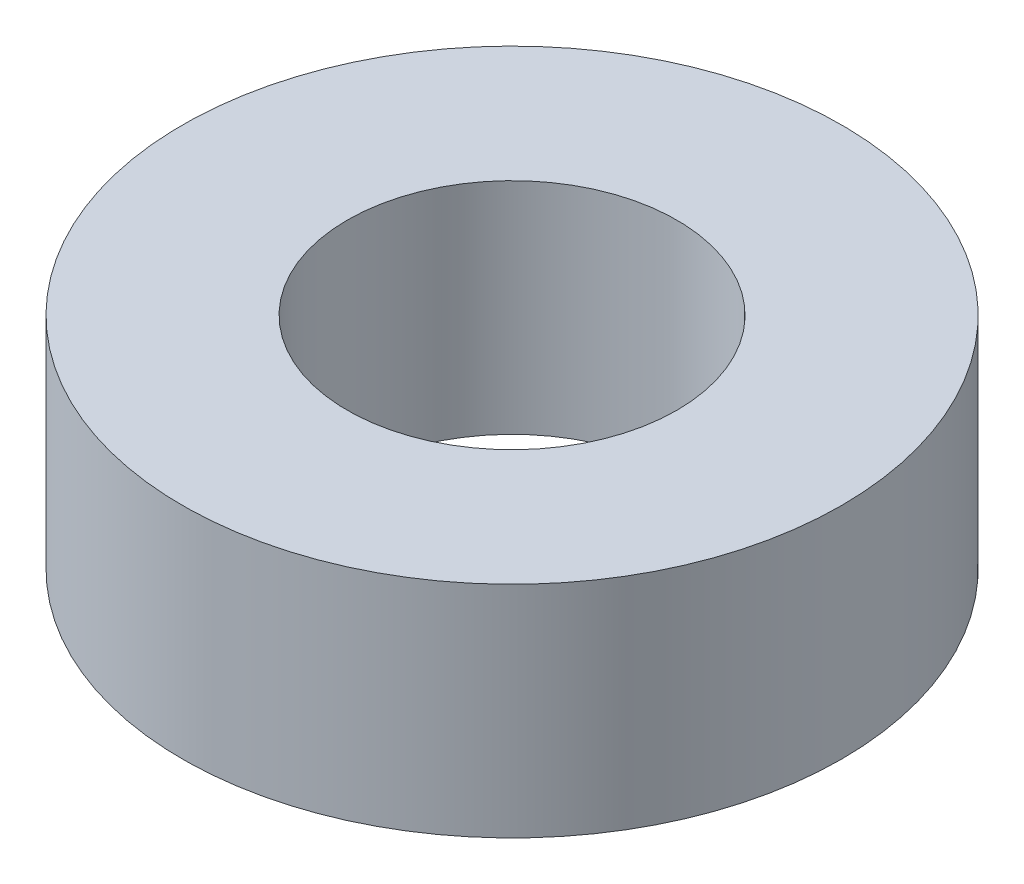
ISO-10303-21;
HEADER;
FILE_DESCRIPTION(('STEP AP214'),'2;1');
FILE_NAME('part.step','',(''),(''),'','','');
FILE_SCHEMA(('AUTOMOTIVE_DESIGN { 1 0 10303 214 1 1 1 1 }'));
ENDSEC;
DATA;
#1=APPLICATION_CONTEXT('core data for automotive mechanical design processes');
#2=APPLICATION_PROTOCOL_DEFINITION('international standard','automotive_design',2000,#1);
#3=PRODUCT_CONTEXT('',#1,'mechanical');
#4=PRODUCT('Part','Part','',(#3));
#5=PRODUCT_RELATED_PRODUCT_CATEGORY('part','',(#4));
#6=PRODUCT_DEFINITION_FORMATION('','',#4);
#7=PRODUCT_DEFINITION_CONTEXT('part definition',#1,'design');
#8=PRODUCT_DEFINITION('design','',#6,#7);
#9=PRODUCT_DEFINITION_SHAPE('','',#8);
#10=(LENGTH_UNIT() NAMED_UNIT(*) SI_UNIT(.MILLI.,.METRE.));
#11=(NAMED_UNIT(*) PLANE_ANGLE_UNIT() SI_UNIT($,.RADIAN.));
#12=(NAMED_UNIT(*) SI_UNIT($,.STERADIAN.) SOLID_ANGLE_UNIT());
#13=UNCERTAINTY_MEASURE_WITH_UNIT(LENGTH_MEASURE(1.E-05),#10,'distance_accuracy_value','');
#14=(GEOMETRIC_REPRESENTATION_CONTEXT(3) GLOBAL_UNCERTAINTY_ASSIGNED_CONTEXT((#13)) GLOBAL_UNIT_ASSIGNED_CONTEXT((#10,
#11,#12)) REPRESENTATION_CONTEXT('',''));
#15=CARTESIAN_POINT('',(0.,0.,0.));
#16=DIRECTION('',(0.,0.,1.));
#17=DIRECTION('',(1.,0.,0.));
#18=AXIS2_PLACEMENT_3D('',#15,#16,#17);
#19=CARTESIAN_POINT('',(1328.7375,-19.05,-241.3));
#20=DIRECTION('',(0.,1.,0.));
#21=DIRECTION('',(0.,0.,1.));
#22=AXIS2_PLACEMENT_3D('',#19,#20,#21);
#23=CYLINDRICAL_SURFACE('',#22,9.525);
#24=CARTESIAN_POINT('',(1328.7375,-19.05,-241.3));
#25=DIRECTION('',(0.,-1.,0.));
#26=DIRECTION('',(1.,0.,0.));
#27=AXIS2_PLACEMENT_3D('',#24,#25,#26);
#28=CIRCLE('',#27,9.525);
#29=CARTESIAN_POINT('',(1338.2625,-19.05,-241.3));
#30=VERTEX_POINT('',#29);
#31=EDGE_CURVE('E20',#30,#30,#28,.T.);
#32=ORIENTED_EDGE('',*,*,#31,.T.);
#33=EDGE_LOOP('',(#32));
#34=FACE_BOUND('',#33,.T.);
#35=CARTESIAN_POINT('',(1328.7375,-6.35,-241.3));
#36=DIRECTION('',(0.,-1.,0.));
#37=DIRECTION('',(1.,0.,0.));
#38=AXIS2_PLACEMENT_3D('',#35,#36,#37);
#39=CIRCLE('',#38,9.525);
#40=CARTESIAN_POINT('',(1338.2625,-6.35,-241.3));
#41=VERTEX_POINT('',#40);
#42=EDGE_CURVE('E31',#41,#41,#39,.T.);
#43=ORIENTED_EDGE('',*,*,#42,.F.);
#44=EDGE_LOOP('',(#43));
#45=FACE_BOUND('',#44,.T.);
#46=ADVANCED_FACE('F12',(#34,#45),#23,.F.);
#47=CARTESIAN_POINT('',(1328.7375,-19.05,-241.3));
#48=DIRECTION('',(0.,1.,0.));
#49=DIRECTION('',(0.,0.,1.));
#50=AXIS2_PLACEMENT_3D('',#47,#48,#49);
#51=CYLINDRICAL_SURFACE('',#50,19.05);
#52=CARTESIAN_POINT('',(1328.7375,-19.05,-241.3));
#53=DIRECTION('',(0.,-1.,0.));
#54=DIRECTION('',(1.,0.,0.));
#55=AXIS2_PLACEMENT_3D('',#52,#53,#54);
#56=CIRCLE('',#55,19.05);
#57=CARTESIAN_POINT('',(1347.7875,-19.05,-241.3));
#58=VERTEX_POINT('',#57);
#59=EDGE_CURVE('E8',#58,#58,#56,.T.);
#60=ORIENTED_EDGE('',*,*,#59,.F.);
#61=EDGE_LOOP('',(#60));
#62=FACE_BOUND('',#61,.T.);
#63=CARTESIAN_POINT('',(1328.7375,-6.35,-241.3));
#64=DIRECTION('',(0.,-1.,0.));
#65=DIRECTION('',(1.,0.,0.));
#66=AXIS2_PLACEMENT_3D('',#63,#64,#65);
#67=CIRCLE('',#66,19.05);
#68=CARTESIAN_POINT('',(1347.7875,-6.35,-241.3));
#69=VERTEX_POINT('',#68);
#70=EDGE_CURVE('E15',#69,#69,#67,.T.);
#71=ORIENTED_EDGE('',*,*,#70,.T.);
#72=EDGE_LOOP('',(#71));
#73=FACE_BOUND('',#72,.T.);
#74=ADVANCED_FACE('F41',(#62,#73),#51,.T.);
#75=CARTESIAN_POINT('',(1328.7375,-19.05,-152.4));
#76=DIRECTION('',(0.,-1.,0.));
#77=DIRECTION('',(1.,0.,0.));
#78=AXIS2_PLACEMENT_3D('',#75,#76,#77);
#79=PLANE('',#78);
#80=ORIENTED_EDGE('',*,*,#31,.F.);
#81=EDGE_LOOP('',(#80));
#82=FACE_BOUND('',#81,.T.);
#83=ORIENTED_EDGE('',*,*,#59,.T.);
#84=EDGE_LOOP('',(#83));
#85=FACE_BOUND('',#84,.T.);
#86=ADVANCED_FACE('F45',(#82,#85),#79,.T.);
#87=CARTESIAN_POINT('',(1328.7375,-6.35,-152.4));
#88=DIRECTION('',(0.,-1.,0.));
#89=DIRECTION('',(1.,0.,0.));
#90=AXIS2_PLACEMENT_3D('',#87,#88,#89);
#91=PLANE('',#90);
#92=ORIENTED_EDGE('',*,*,#42,.T.);
#93=EDGE_LOOP('',(#92));
#94=FACE_BOUND('',#93,.T.);
#95=ORIENTED_EDGE('',*,*,#70,.F.);
#96=EDGE_LOOP('',(#95));
#97=FACE_BOUND('',#96,.T.);
#98=ADVANCED_FACE('F43',(#94,#97),#91,.F.);
#99=CLOSED_SHELL('',(#46,#74,#86,#98));
#100=MANIFOLD_SOLID_BREP('B1',#99);
#101=ADVANCED_BREP_SHAPE_REPRESENTATION('',(#18,#100),#14);
#102=SHAPE_DEFINITION_REPRESENTATION(#9,#101);
ENDSEC;
END-ISO-10303-21;
